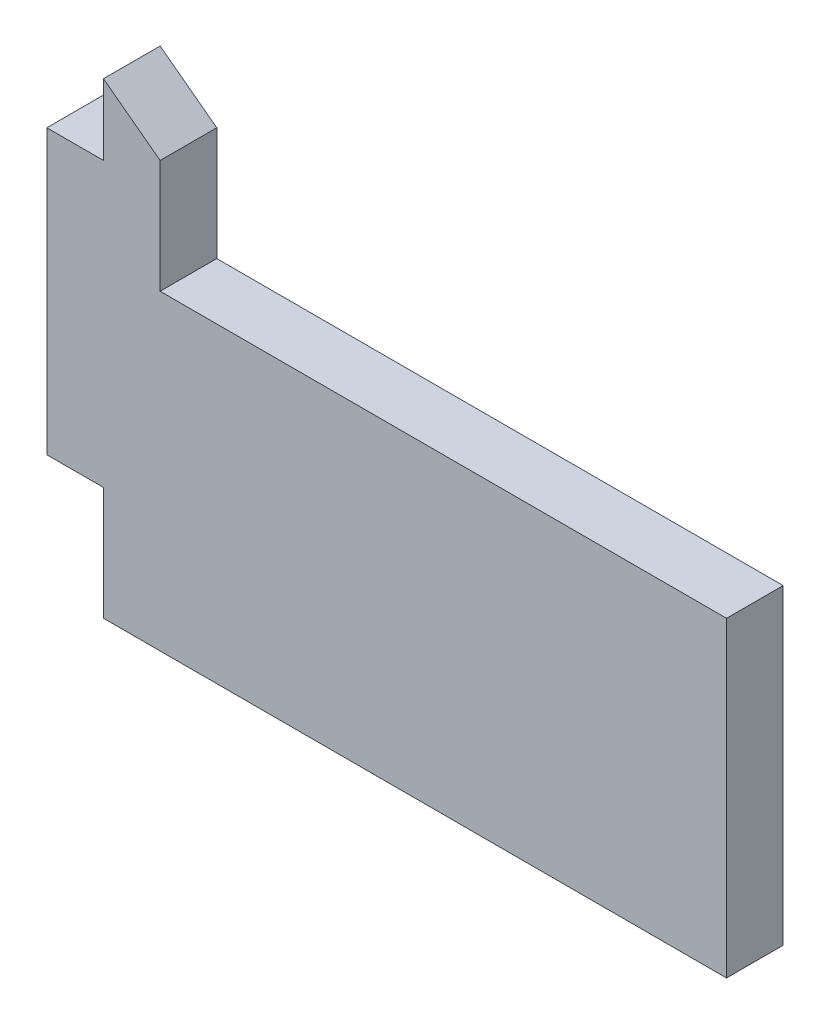
ISO-10303-21;
HEADER;
FILE_DESCRIPTION(('STEP AP214'),'2;1');
FILE_NAME('part.step','',(''),(''),'','','');
FILE_SCHEMA(('AUTOMOTIVE_DESIGN { 1 0 10303 214 1 1 1 1 }'));
ENDSEC;
DATA;
#1=APPLICATION_CONTEXT('core data for automotive mechanical design processes');
#2=APPLICATION_PROTOCOL_DEFINITION('international standard','automotive_design',2000,#1);
#3=PRODUCT_CONTEXT('',#1,'mechanical');
#4=PRODUCT('Part','Part','',(#3));
#5=PRODUCT_RELATED_PRODUCT_CATEGORY('part','',(#4));
#6=PRODUCT_DEFINITION_FORMATION('','',#4);
#7=PRODUCT_DEFINITION_CONTEXT('part definition',#1,'design');
#8=PRODUCT_DEFINITION('design','',#6,#7);
#9=PRODUCT_DEFINITION_SHAPE('','',#8);
#10=(LENGTH_UNIT() NAMED_UNIT(*) SI_UNIT(.MILLI.,.METRE.));
#11=(NAMED_UNIT(*) PLANE_ANGLE_UNIT() SI_UNIT($,.RADIAN.));
#12=(NAMED_UNIT(*) SI_UNIT($,.STERADIAN.) SOLID_ANGLE_UNIT());
#13=UNCERTAINTY_MEASURE_WITH_UNIT(LENGTH_MEASURE(1.E-05),#10,'distance_accuracy_value','');
#14=(GEOMETRIC_REPRESENTATION_CONTEXT(3) GLOBAL_UNCERTAINTY_ASSIGNED_CONTEXT((#13)) GLOBAL_UNIT_ASSIGNED_CONTEXT((#10,
#11,#12)) REPRESENTATION_CONTEXT('',''));
#15=CARTESIAN_POINT('',(0.,0.,0.));
#16=DIRECTION('',(0.,0.,1.));
#17=DIRECTION('',(1.,0.,0.));
#18=AXIS2_PLACEMENT_3D('',#15,#16,#17);
#19=CARTESIAN_POINT('',(2.,0.,2.));
#20=DIRECTION('',(0.,1.,0.));
#21=DIRECTION('',(0.,0.,1.));
#22=AXIS2_PLACEMENT_3D('',#19,#20,#21);
#23=PLANE('',#22);
#24=DIRECTION('',(1.,0.,0.));
#25=VECTOR('',#24,1.);
#26=CARTESIAN_POINT('',(2.,0.,0.));
#27=LINE('',#26,#25);
#28=CARTESIAN_POINT('',(0.,0.,0.));
#29=VERTEX_POINT('',#28);
#30=CARTESIAN_POINT('',(2.,0.,0.));
#31=VERTEX_POINT('',#30);
#32=EDGE_CURVE('E152',#29,#31,#27,.T.);
#33=ORIENTED_EDGE('',*,*,#32,.T.);
#34=DIRECTION('',(0.,0.,-1.));
#35=VECTOR('',#34,1.);
#36=CARTESIAN_POINT('',(2.,0.,2.));
#37=LINE('',#36,#35);
#38=CARTESIAN_POINT('',(2.,0.,2.));
#39=VERTEX_POINT('',#38);
#40=EDGE_CURVE('E11',#39,#31,#37,.T.);
#41=ORIENTED_EDGE('',*,*,#40,.F.);
#42=DIRECTION('',(1.,0.,0.));
#43=VECTOR('',#42,1.);
#44=CARTESIAN_POINT('',(2.,0.,2.));
#45=LINE('',#44,#43);
#46=CARTESIAN_POINT('',(0.,0.,2.));
#47=VERTEX_POINT('',#46);
#48=EDGE_CURVE('E180',#47,#39,#45,.T.);
#49=ORIENTED_EDGE('',*,*,#48,.F.);
#50=DIRECTION('',(0.,0.,-1.));
#51=VECTOR('',#50,1.);
#52=CARTESIAN_POINT('',(0.,0.,2.));
#53=LINE('',#52,#51);
#54=EDGE_CURVE('E148',#47,#29,#53,.T.);
#55=ORIENTED_EDGE('',*,*,#54,.T.);
#56=EDGE_LOOP('',(#33,#41,#49,#55));
#57=FACE_BOUND('',#56,.T.);
#58=ADVANCED_FACE('F39',(#57),#23,.F.);
#59=CARTESIAN_POINT('',(2.,-4.,2.));
#60=DIRECTION('',(1.,0.,0.));
#61=DIRECTION('',(0.,0.,-1.));
#62=AXIS2_PLACEMENT_3D('',#59,#60,#61);
#63=PLANE('',#62);
#64=DIRECTION('',(0.,-1.,0.));
#65=VECTOR('',#64,1.);
#66=CARTESIAN_POINT('',(2.,-4.,0.));
#67=LINE('',#66,#65);
#68=CARTESIAN_POINT('',(2.,-4.,0.));
#69=VERTEX_POINT('',#68);
#70=EDGE_CURVE('E156',#31,#69,#67,.T.);
#71=ORIENTED_EDGE('',*,*,#70,.T.);
#72=DIRECTION('',(0.,0.,-1.));
#73=VECTOR('',#72,1.);
#74=CARTESIAN_POINT('',(2.,-4.,2.));
#75=LINE('',#74,#73);
#76=CARTESIAN_POINT('',(2.,-4.,2.));
#77=VERTEX_POINT('',#76);
#78=EDGE_CURVE('E48',#77,#69,#75,.T.);
#79=ORIENTED_EDGE('',*,*,#78,.F.);
#80=DIRECTION('',(0.,-1.,0.));
#81=VECTOR('',#80,1.);
#82=CARTESIAN_POINT('',(2.,-4.,2.));
#83=LINE('',#82,#81);
#84=EDGE_CURVE('E105',#39,#77,#83,.T.);
#85=ORIENTED_EDGE('',*,*,#84,.F.);
#86=ORIENTED_EDGE('',*,*,#40,.T.);
#87=EDGE_LOOP('',(#71,#79,#85,#86));
#88=FACE_BOUND('',#87,.T.);
#89=ADVANCED_FACE('F244',(#88),#63,.F.);
#90=CARTESIAN_POINT('',(24.,-4.,2.));
#91=DIRECTION('',(0.,1.,0.));
#92=DIRECTION('',(-1.,0.,0.));
#93=AXIS2_PLACEMENT_3D('',#90,#91,#92);
#94=PLANE('',#93);
#95=DIRECTION('',(1.,0.,0.));
#96=VECTOR('',#95,1.);
#97=CARTESIAN_POINT('',(24.,-4.,0.));
#98=LINE('',#97,#96);
#99=CARTESIAN_POINT('',(24.,-4.,0.));
#100=VERTEX_POINT('',#99);
#101=EDGE_CURVE('E159',#69,#100,#98,.T.);
#102=ORIENTED_EDGE('',*,*,#101,.T.);
#103=DIRECTION('',(0.,0.,-1.));
#104=VECTOR('',#103,1.);
#105=CARTESIAN_POINT('',(24.,-4.,2.));
#106=LINE('',#105,#104);
#107=CARTESIAN_POINT('',(24.,-4.,2.));
#108=VERTEX_POINT('',#107);
#109=EDGE_CURVE('E199',#108,#100,#106,.T.);
#110=ORIENTED_EDGE('',*,*,#109,.F.);
#111=DIRECTION('',(1.,0.,0.));
#112=VECTOR('',#111,1.);
#113=CARTESIAN_POINT('',(24.,-4.,2.));
#114=LINE('',#113,#112);
#115=EDGE_CURVE('E209',#77,#108,#114,.T.);
#116=ORIENTED_EDGE('',*,*,#115,.F.);
#117=ORIENTED_EDGE('',*,*,#78,.T.);
#118=EDGE_LOOP('',(#102,#110,#116,#117));
#119=FACE_BOUND('',#118,.T.);
#120=ADVANCED_FACE('F207',(#119),#94,.F.);
#121=CARTESIAN_POINT('',(24.,7.00000000000001,2.));
#122=DIRECTION('',(-1.,0.,0.));
#123=DIRECTION('',(0.,-1.,0.));
#124=AXIS2_PLACEMENT_3D('',#121,#122,#123);
#125=PLANE('',#124);
#126=DIRECTION('',(0.,1.,0.));
#127=VECTOR('',#126,1.);
#128=CARTESIAN_POINT('',(24.,7.00000000000001,0.));
#129=LINE('',#128,#127);
#130=CARTESIAN_POINT('',(24.,7.00000000000001,0.));
#131=VERTEX_POINT('',#130);
#132=EDGE_CURVE('E162',#100,#131,#129,.T.);
#133=ORIENTED_EDGE('',*,*,#132,.T.);
#134=DIRECTION('',(0.,0.,-1.));
#135=VECTOR('',#134,1.);
#136=CARTESIAN_POINT('',(24.,7.00000000000001,2.));
#137=LINE('',#136,#135);
#138=CARTESIAN_POINT('',(24.,7.00000000000001,2.));
#139=VERTEX_POINT('',#138);
#140=EDGE_CURVE('E195',#139,#131,#137,.T.);
#141=ORIENTED_EDGE('',*,*,#140,.F.);
#142=DIRECTION('',(0.,1.,0.));
#143=VECTOR('',#142,1.);
#144=CARTESIAN_POINT('',(24.,7.00000000000001,2.));
#145=LINE('',#144,#143);
#146=EDGE_CURVE('E228',#108,#139,#145,.T.);
#147=ORIENTED_EDGE('',*,*,#146,.F.);
#148=ORIENTED_EDGE('',*,*,#109,.T.);
#149=EDGE_LOOP('',(#133,#141,#147,#148));
#150=FACE_BOUND('',#149,.T.);
#151=ADVANCED_FACE('F218',(#150),#125,.F.);
#152=CARTESIAN_POINT('',(4.,7.00000000000001,2.));
#153=DIRECTION('',(0.,-1.,0.));
#154=DIRECTION('',(0.,0.,-1.));
#155=AXIS2_PLACEMENT_3D('',#152,#153,#154);
#156=PLANE('',#155);
#157=DIRECTION('',(-1.,0.,0.));
#158=VECTOR('',#157,1.);
#159=CARTESIAN_POINT('',(4.,7.00000000000001,0.));
#160=LINE('',#159,#158);
#161=CARTESIAN_POINT('',(4.,7.00000000000001,0.));
#162=VERTEX_POINT('',#161);
#163=EDGE_CURVE('E165',#131,#162,#160,.T.);
#164=ORIENTED_EDGE('',*,*,#163,.T.);
#165=DIRECTION('',(0.,0.,-1.));
#166=VECTOR('',#165,1.);
#167=CARTESIAN_POINT('',(4.,7.00000000000001,2.));
#168=LINE('',#167,#166);
#169=CARTESIAN_POINT('',(4.,7.00000000000001,2.));
#170=VERTEX_POINT('',#169);
#171=EDGE_CURVE('E191',#170,#162,#168,.T.);
#172=ORIENTED_EDGE('',*,*,#171,.F.);
#173=DIRECTION('',(-1.,0.,0.));
#174=VECTOR('',#173,1.);
#175=CARTESIAN_POINT('',(4.,7.00000000000001,2.));
#176=LINE('',#175,#174);
#177=EDGE_CURVE('E224',#139,#170,#176,.T.);
#178=ORIENTED_EDGE('',*,*,#177,.F.);
#179=ORIENTED_EDGE('',*,*,#140,.T.);
#180=EDGE_LOOP('',(#164,#172,#178,#179));
#181=FACE_BOUND('',#180,.T.);
#182=ADVANCED_FACE('F222',(#181),#156,.F.);
#183=CARTESIAN_POINT('',(4.,11.,2.));
#184=DIRECTION('',(-1.,0.,0.));
#185=DIRECTION('',(0.,-1.,0.));
#186=AXIS2_PLACEMENT_3D('',#183,#184,#185);
#187=PLANE('',#186);
#188=DIRECTION('',(0.,1.,0.));
#189=VECTOR('',#188,1.);
#190=CARTESIAN_POINT('',(4.,11.,0.));
#191=LINE('',#190,#189);
#192=CARTESIAN_POINT('',(4.,11.,0.));
#193=VERTEX_POINT('',#192);
#194=EDGE_CURVE('E168',#162,#193,#191,.T.);
#195=ORIENTED_EDGE('',*,*,#194,.T.);
#196=DIRECTION('',(0.,0.,-1.));
#197=VECTOR('',#196,1.);
#198=CARTESIAN_POINT('',(4.,11.,2.));
#199=LINE('',#198,#197);
#200=CARTESIAN_POINT('',(4.,11.,2.));
#201=VERTEX_POINT('',#200);
#202=EDGE_CURVE('E187',#201,#193,#199,.T.);
#203=ORIENTED_EDGE('',*,*,#202,.F.);
#204=DIRECTION('',(0.,1.,0.));
#205=VECTOR('',#204,1.);
#206=CARTESIAN_POINT('',(4.,11.,2.));
#207=LINE('',#206,#205);
#208=EDGE_CURVE('E227',#170,#201,#207,.T.);
#209=ORIENTED_EDGE('',*,*,#208,.F.);
#210=ORIENTED_EDGE('',*,*,#171,.T.);
#211=EDGE_LOOP('',(#195,#203,#209,#210));
#212=FACE_BOUND('',#211,.T.);
#213=ADVANCED_FACE('F256',(#212),#187,.F.);
#214=CARTESIAN_POINT('',(2.,12.5,2.));
#215=DIRECTION('',(-0.6,-0.8,0.));
#216=DIRECTION('',(0.8,-0.6,0.));
#217=AXIS2_PLACEMENT_3D('',#214,#215,#216);
#218=PLANE('',#217);
#219=DIRECTION('',(-0.8,0.6,0.));
#220=VECTOR('',#219,1.);
#221=CARTESIAN_POINT('',(2.,12.5,0.));
#222=LINE('',#221,#220);
#223=CARTESIAN_POINT('',(2.,12.5,0.));
#224=VERTEX_POINT('',#223);
#225=EDGE_CURVE('E171',#193,#224,#222,.T.);
#226=ORIENTED_EDGE('',*,*,#225,.T.);
#227=DIRECTION('',(0.,0.,-1.));
#228=VECTOR('',#227,1.);
#229=CARTESIAN_POINT('',(2.,12.5,2.));
#230=LINE('',#229,#228);
#231=CARTESIAN_POINT('',(2.,12.5,2.));
#232=VERTEX_POINT('',#231);
#233=EDGE_CURVE('E141',#232,#224,#230,.T.);
#234=ORIENTED_EDGE('',*,*,#233,.F.);
#235=DIRECTION('',(-0.8,0.6,0.));
#236=VECTOR('',#235,1.);
#237=CARTESIAN_POINT('',(2.,12.5,2.));
#238=LINE('',#237,#236);
#239=EDGE_CURVE('E130',#201,#232,#238,.T.);
#240=ORIENTED_EDGE('',*,*,#239,.F.);
#241=ORIENTED_EDGE('',*,*,#202,.T.);
#242=EDGE_LOOP('',(#226,#234,#240,#241));
#243=FACE_BOUND('',#242,.T.);
#244=ADVANCED_FACE('F259',(#243),#218,.F.);
#245=CARTESIAN_POINT('',(2.,10.,2.));
#246=DIRECTION('',(1.,0.,0.));
#247=DIRECTION('',(0.,0.,-1.));
#248=AXIS2_PLACEMENT_3D('',#245,#246,#247);
#249=PLANE('',#248);
#250=DIRECTION('',(0.,-1.,0.));
#251=VECTOR('',#250,1.);
#252=CARTESIAN_POINT('',(2.,10.,0.));
#253=LINE('',#252,#251);
#254=CARTESIAN_POINT('',(2.,10.,0.));
#255=VERTEX_POINT('',#254);
#256=EDGE_CURVE('E139',#224,#255,#253,.T.);
#257=ORIENTED_EDGE('',*,*,#256,.T.);
#258=DIRECTION('',(0.,0.,-1.));
#259=VECTOR('',#258,1.);
#260=CARTESIAN_POINT('',(2.,10.,2.));
#261=LINE('',#260,#259);
#262=CARTESIAN_POINT('',(2.,10.,2.));
#263=VERTEX_POINT('',#262);
#264=EDGE_CURVE('E136',#263,#255,#261,.T.);
#265=ORIENTED_EDGE('',*,*,#264,.F.);
#266=DIRECTION('',(0.,-1.,0.));
#267=VECTOR('',#266,1.);
#268=CARTESIAN_POINT('',(2.,10.,2.));
#269=LINE('',#268,#267);
#270=EDGE_CURVE('E124',#232,#263,#269,.T.);
#271=ORIENTED_EDGE('',*,*,#270,.F.);
#272=ORIENTED_EDGE('',*,*,#233,.T.);
#273=EDGE_LOOP('',(#257,#265,#271,#272));
#274=FACE_BOUND('',#273,.T.);
#275=ADVANCED_FACE('F137',(#274),#249,.F.);
#276=CARTESIAN_POINT('',(0.,10.,2.));
#277=DIRECTION('',(0.,-1.,0.));
#278=DIRECTION('',(0.,0.,-1.));
#279=AXIS2_PLACEMENT_3D('',#276,#277,#278);
#280=PLANE('',#279);
#281=DIRECTION('',(-1.,0.,0.));
#282=VECTOR('',#281,1.);
#283=CARTESIAN_POINT('',(0.,10.,0.));
#284=LINE('',#283,#282);
#285=CARTESIAN_POINT('',(0.,10.,0.));
#286=VERTEX_POINT('',#285);
#287=EDGE_CURVE('E91',#255,#286,#284,.T.);
#288=ORIENTED_EDGE('',*,*,#287,.T.);
#289=DIRECTION('',(0.,0.,-1.));
#290=VECTOR('',#289,1.);
#291=CARTESIAN_POINT('',(0.,10.,2.));
#292=LINE('',#291,#290);
#293=CARTESIAN_POINT('',(0.,10.,2.));
#294=VERTEX_POINT('',#293);
#295=EDGE_CURVE('E142',#294,#286,#292,.T.);
#296=ORIENTED_EDGE('',*,*,#295,.F.);
#297=DIRECTION('',(-1.,0.,0.));
#298=VECTOR('',#297,1.);
#299=CARTESIAN_POINT('',(0.,10.,2.));
#300=LINE('',#299,#298);
#301=EDGE_CURVE('E128',#263,#294,#300,.T.);
#302=ORIENTED_EDGE('',*,*,#301,.F.);
#303=ORIENTED_EDGE('',*,*,#264,.T.);
#304=EDGE_LOOP('',(#288,#296,#302,#303));
#305=FACE_BOUND('',#304,.T.);
#306=ADVANCED_FACE('F144',(#305),#280,.F.);
#307=CARTESIAN_POINT('',(0.,0.,2.));
#308=DIRECTION('',(1.,0.,0.));
#309=DIRECTION('',(0.,0.,-1.));
#310=AXIS2_PLACEMENT_3D('',#307,#308,#309);
#311=PLANE('',#310);
#312=DIRECTION('',(0.,-1.,0.));
#313=VECTOR('',#312,1.);
#314=CARTESIAN_POINT('',(0.,0.,0.));
#315=LINE('',#314,#313);
#316=EDGE_CURVE('E97',#286,#29,#315,.T.);
#317=ORIENTED_EDGE('',*,*,#316,.T.);
#318=ORIENTED_EDGE('',*,*,#54,.F.);
#319=DIRECTION('',(0.,-1.,0.));
#320=VECTOR('',#319,1.);
#321=CARTESIAN_POINT('',(0.,0.,2.));
#322=LINE('',#321,#320);
#323=EDGE_CURVE('E56',#294,#47,#322,.T.);
#324=ORIENTED_EDGE('',*,*,#323,.F.);
#325=ORIENTED_EDGE('',*,*,#295,.T.);
#326=EDGE_LOOP('',(#317,#318,#324,#325));
#327=FACE_BOUND('',#326,.T.);
#328=ADVANCED_FACE('F268',(#327),#311,.F.);
#329=CARTESIAN_POINT('',(0.,0.,2.));
#330=DIRECTION('',(0.,0.,-1.));
#331=DIRECTION('',(-1.,0.,0.));
#332=AXIS2_PLACEMENT_3D('',#329,#330,#331);
#333=PLANE('',#332);
#334=ORIENTED_EDGE('',*,*,#48,.T.);
#335=ORIENTED_EDGE('',*,*,#84,.T.);
#336=ORIENTED_EDGE('',*,*,#115,.T.);
#337=ORIENTED_EDGE('',*,*,#146,.T.);
#338=ORIENTED_EDGE('',*,*,#177,.T.);
#339=ORIENTED_EDGE('',*,*,#208,.T.);
#340=ORIENTED_EDGE('',*,*,#239,.T.);
#341=ORIENTED_EDGE('',*,*,#270,.T.);
#342=ORIENTED_EDGE('',*,*,#301,.T.);
#343=ORIENTED_EDGE('',*,*,#323,.T.);
#344=EDGE_LOOP('',(#334,#335,#336,#337,#338,#339,#340,#341,#342,#343));
#345=FACE_BOUND('',#344,.T.);
#346=ADVANCED_FACE('F126',(#345),#333,.F.);
#347=CARTESIAN_POINT('',(0.,0.,0.));
#348=DIRECTION('',(0.,0.,-1.));
#349=DIRECTION('',(-1.,0.,0.));
#350=AXIS2_PLACEMENT_3D('',#347,#348,#349);
#351=PLANE('',#350);
#352=ORIENTED_EDGE('',*,*,#32,.F.);
#353=ORIENTED_EDGE('',*,*,#316,.F.);
#354=ORIENTED_EDGE('',*,*,#287,.F.);
#355=ORIENTED_EDGE('',*,*,#256,.F.);
#356=ORIENTED_EDGE('',*,*,#225,.F.);
#357=ORIENTED_EDGE('',*,*,#194,.F.);
#358=ORIENTED_EDGE('',*,*,#163,.F.);
#359=ORIENTED_EDGE('',*,*,#132,.F.);
#360=ORIENTED_EDGE('',*,*,#101,.F.);
#361=ORIENTED_EDGE('',*,*,#70,.F.);
#362=EDGE_LOOP('',(#352,#353,#354,#355,#356,#357,#358,#359,#360,#361));
#363=FACE_BOUND('',#362,.T.);
#364=ADVANCED_FACE('F213',(#363),#351,.T.);
#365=CLOSED_SHELL('',(#58,#89,#120,#151,#182,#213,#244,#275,#306,#328,#346,#364));
#366=MANIFOLD_SOLID_BREP('B2',#365);
#367=ADVANCED_BREP_SHAPE_REPRESENTATION('',(#18,#366),#14);
#368=SHAPE_DEFINITION_REPRESENTATION(#9,#367);
ENDSEC;
END-ISO-10303-21;
